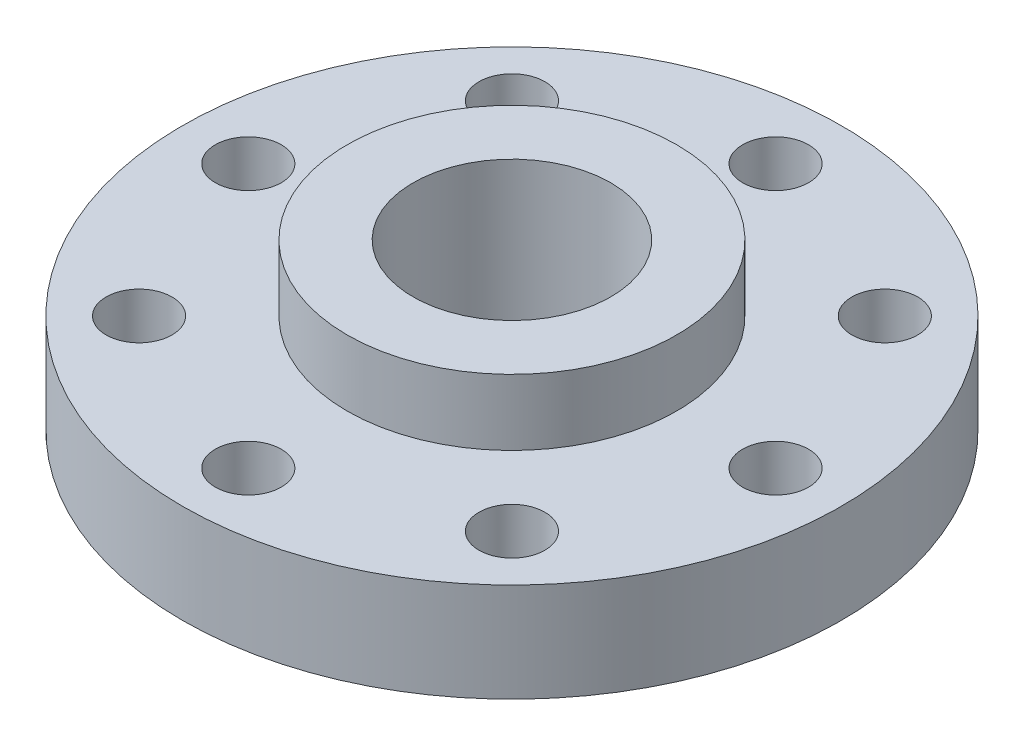
ISO-10303-21;
HEADER;
FILE_DESCRIPTION(('STEP AP214'),'2;1');
FILE_NAME('part.step','',(''),(''),'','','');
FILE_SCHEMA(('AUTOMOTIVE_DESIGN { 1 0 10303 214 1 1 1 1 }'));
ENDSEC;
DATA;
#1=APPLICATION_CONTEXT('core data for automotive mechanical design processes');
#2=APPLICATION_PROTOCOL_DEFINITION('international standard','automotive_design',2000,#1);
#3=PRODUCT_CONTEXT('',#1,'mechanical');
#4=PRODUCT('Part','Part','',(#3));
#5=PRODUCT_RELATED_PRODUCT_CATEGORY('part','',(#4));
#6=PRODUCT_DEFINITION_FORMATION('','',#4);
#7=PRODUCT_DEFINITION_CONTEXT('part definition',#1,'design');
#8=PRODUCT_DEFINITION('design','',#6,#7);
#9=PRODUCT_DEFINITION_SHAPE('','',#8);
#10=(LENGTH_UNIT() NAMED_UNIT(*) SI_UNIT(.MILLI.,.METRE.));
#11=(NAMED_UNIT(*) PLANE_ANGLE_UNIT() SI_UNIT($,.RADIAN.));
#12=(NAMED_UNIT(*) SI_UNIT($,.STERADIAN.) SOLID_ANGLE_UNIT());
#13=UNCERTAINTY_MEASURE_WITH_UNIT(LENGTH_MEASURE(1.E-05),#10,'distance_accuracy_value','');
#14=(GEOMETRIC_REPRESENTATION_CONTEXT(3) GLOBAL_UNCERTAINTY_ASSIGNED_CONTEXT((#13)) GLOBAL_UNIT_ASSIGNED_CONTEXT((#10,
#11,#12)) REPRESENTATION_CONTEXT('',''));
#15=CARTESIAN_POINT('',(0.,0.,0.));
#16=DIRECTION('',(0.,0.,1.));
#17=DIRECTION('',(1.,0.,0.));
#18=AXIS2_PLACEMENT_3D('',#15,#16,#17);
#19=CARTESIAN_POINT('',(0.,3.,0.));
#20=DIRECTION('',(0.,-1.,0.));
#21=DIRECTION('',(0.,0.,-1.));
#22=AXIS2_PLACEMENT_3D('',#19,#20,#21);
#23=CYLINDRICAL_SURFACE('',#22,10.);
#24=CARTESIAN_POINT('',(0.,3.,0.));
#25=DIRECTION('',(0.,1.,0.));
#26=DIRECTION('',(0.,0.,1.));
#27=AXIS2_PLACEMENT_3D('',#24,#25,#26);
#28=CIRCLE('',#27,10.);
#29=CARTESIAN_POINT('',(0.,3.,10.));
#30=VERTEX_POINT('',#29);
#31=EDGE_CURVE('E45',#30,#30,#28,.T.);
#32=ORIENTED_EDGE('',*,*,#31,.F.);
#33=EDGE_LOOP('',(#32));
#34=FACE_BOUND('',#33,.T.);
#35=CARTESIAN_POINT('',(0.,0.,0.));
#36=DIRECTION('',(0.,1.,0.));
#37=DIRECTION('',(0.,0.,1.));
#38=AXIS2_PLACEMENT_3D('',#35,#36,#37);
#39=CIRCLE('',#38,10.);
#40=CARTESIAN_POINT('',(0.,0.,10.));
#41=VERTEX_POINT('',#40);
#42=EDGE_CURVE('E40',#41,#41,#39,.T.);
#43=ORIENTED_EDGE('',*,*,#42,.T.);
#44=EDGE_LOOP('',(#43));
#45=FACE_BOUND('',#44,.T.);
#46=ADVANCED_FACE('F37',(#34,#45),#23,.T.);
#47=CARTESIAN_POINT('',(0.,3.,0.));
#48=DIRECTION('',(0.,1.,0.));
#49=DIRECTION('',(0.,0.,1.));
#50=AXIS2_PLACEMENT_3D('',#47,#48,#49);
#51=PLANE('',#50);
#52=CARTESIAN_POINT('',(0.,3.,8.));
#53=DIRECTION('',(0.,1.,0.));
#54=DIRECTION('',(0.,0.,1.));
#55=AXIS2_PLACEMENT_3D('',#52,#53,#54);
#56=CIRCLE('',#55,1.);
#57=CARTESIAN_POINT('',(0.,3.,9.));
#58=VERTEX_POINT('',#57);
#59=EDGE_CURVE('E56',#58,#58,#56,.T.);
#60=ORIENTED_EDGE('',*,*,#59,.F.);
#61=EDGE_LOOP('',(#60));
#62=FACE_BOUND('',#61,.T.);
#63=CARTESIAN_POINT('',(5.65685424949245,3.,5.65685424949262));
#64=DIRECTION('',(0.,1.,0.));
#65=DIRECTION('',(0.,0.,1.));
#66=AXIS2_PLACEMENT_3D('',#63,#64,#65);
#67=CIRCLE('',#66,1.);
#68=CARTESIAN_POINT('',(5.65685424949245,3.,6.65685424949262));
#69=VERTEX_POINT('',#68);
#70=EDGE_CURVE('E60',#69,#69,#67,.T.);
#71=ORIENTED_EDGE('',*,*,#70,.F.);
#72=EDGE_LOOP('',(#71));
#73=FACE_BOUND('',#72,.T.);
#74=CARTESIAN_POINT('',(8.00000000000031,3.,3.3963373171828E-13));
#75=DIRECTION('',(0.,1.,0.));
#76=DIRECTION('',(0.,0.,1.));
#77=AXIS2_PLACEMENT_3D('',#74,#75,#76);
#78=CIRCLE('',#77,1.);
#79=CARTESIAN_POINT('',(8.00000000000031,3.,1.00000000000034));
#80=VERTEX_POINT('',#79);
#81=EDGE_CURVE('E64',#80,#80,#78,.T.);
#82=ORIENTED_EDGE('',*,*,#81,.F.);
#83=EDGE_LOOP('',(#82));
#84=FACE_BOUND('',#83,.T.);
#85=CARTESIAN_POINT('',(5.65685424949293,3.,-5.65685424949214));
#86=DIRECTION('',(0.,1.,0.));
#87=DIRECTION('',(0.,0.,1.));
#88=AXIS2_PLACEMENT_3D('',#85,#86,#87);
#89=CIRCLE('',#88,1.);
#90=CARTESIAN_POINT('',(5.65685424949293,3.,-4.65685424949214));
#91=VERTEX_POINT('',#90);
#92=EDGE_CURVE('E68',#91,#91,#89,.T.);
#93=ORIENTED_EDGE('',*,*,#92,.F.);
#94=EDGE_LOOP('',(#93));
#95=FACE_BOUND('',#94,.T.);
#96=CARTESIAN_POINT('',(6.49541144935068E-13,3.,-8.));
#97=DIRECTION('',(0.,1.,0.));
#98=DIRECTION('',(0.,0.,1.));
#99=AXIS2_PLACEMENT_3D('',#96,#97,#98);
#100=CIRCLE('',#99,1.);
#101=CARTESIAN_POINT('',(6.49541144935068E-13,3.,-7.));
#102=VERTEX_POINT('',#101);
#103=EDGE_CURVE('E72',#102,#102,#100,.T.);
#104=ORIENTED_EDGE('',*,*,#103,.F.);
#105=EDGE_LOOP('',(#104));
#106=FACE_BOUND('',#105,.T.);
#107=CARTESIAN_POINT('',(-5.65685424949183,3.,-5.65685424949262));
#108=DIRECTION('',(0.,1.,0.));
#109=DIRECTION('',(0.,0.,1.));
#110=AXIS2_PLACEMENT_3D('',#107,#108,#109);
#111=CIRCLE('',#110,1.);
#112=CARTESIAN_POINT('',(-5.65685424949183,3.,-4.65685424949262));
#113=VERTEX_POINT('',#112);
#114=EDGE_CURVE('E76',#113,#113,#111,.T.);
#115=ORIENTED_EDGE('',*,*,#114,.F.);
#116=EDGE_LOOP('',(#115));
#117=FACE_BOUND('',#116,.T.);
#118=CARTESIAN_POINT('',(-7.99999999999969,3.,-3.40527859732781E-13));
#119=DIRECTION('',(0.,1.,0.));
#120=DIRECTION('',(0.,0.,1.));
#121=AXIS2_PLACEMENT_3D('',#118,#119,#120);
#122=CIRCLE('',#121,1.);
#123=CARTESIAN_POINT('',(-7.99999999999969,3.,0.999999999999659));
#124=VERTEX_POINT('',#123);
#125=EDGE_CURVE('E80',#124,#124,#122,.T.);
#126=ORIENTED_EDGE('',*,*,#125,.F.);
#127=EDGE_LOOP('',(#126));
#128=FACE_BOUND('',#127,.T.);
#129=CARTESIAN_POINT('',(-5.65685424949231,3.,5.65685424949214));
#130=DIRECTION('',(0.,1.,0.));
#131=DIRECTION('',(0.,0.,1.));
#132=AXIS2_PLACEMENT_3D('',#129,#130,#131);
#133=CIRCLE('',#132,0.999999999999999);
#134=CARTESIAN_POINT('',(-5.65685424949231,3.,6.65685424949214));
#135=VERTEX_POINT('',#134);
#136=EDGE_CURVE('E84',#135,#135,#133,.T.);
#137=ORIENTED_EDGE('',*,*,#136,.F.);
#138=EDGE_LOOP('',(#137));
#139=FACE_BOUND('',#138,.T.);
#140=CARTESIAN_POINT('',(0.,3.,0.));
#141=DIRECTION('',(0.,1.,0.));
#142=DIRECTION('',(0.,0.,1.));
#143=AXIS2_PLACEMENT_3D('',#140,#141,#142);
#144=CIRCLE('',#143,5.);
#145=CARTESIAN_POINT('',(0.,3.,5.));
#146=VERTEX_POINT('',#145);
#147=EDGE_CURVE('E10',#146,#146,#144,.T.);
#148=ORIENTED_EDGE('',*,*,#147,.F.);
#149=EDGE_LOOP('',(#148));
#150=FACE_BOUND('',#149,.T.);
#151=ORIENTED_EDGE('',*,*,#31,.T.);
#152=EDGE_LOOP('',(#151));
#153=FACE_BOUND('',#152,.T.);
#154=ADVANCED_FACE('F135',(#62,#73,#84,#95,#106,#117,#128,#139,#150,#153),#51,.T.);
#155=CARTESIAN_POINT('',(0.,0.,0.));
#156=DIRECTION('',(0.,1.,0.));
#157=DIRECTION('',(0.,0.,1.));
#158=AXIS2_PLACEMENT_3D('',#155,#156,#157);
#159=PLANE('',#158);
#160=CARTESIAN_POINT('',(0.,0.,8.));
#161=DIRECTION('',(0.,-1.,0.));
#162=DIRECTION('',(0.,0.,-1.));
#163=AXIS2_PLACEMENT_3D('',#160,#161,#162);
#164=CIRCLE('',#163,1.);
#165=CARTESIAN_POINT('',(0.,0.,7.));
#166=VERTEX_POINT('',#165);
#167=EDGE_CURVE('E93',#166,#166,#164,.T.);
#168=ORIENTED_EDGE('',*,*,#167,.F.);
#169=EDGE_LOOP('',(#168));
#170=FACE_BOUND('',#169,.T.);
#171=CARTESIAN_POINT('',(5.65685424949245,0.,5.65685424949262));
#172=DIRECTION('',(0.,-1.,0.));
#173=DIRECTION('',(0.,0.,-1.));
#174=AXIS2_PLACEMENT_3D('',#171,#172,#173);
#175=CIRCLE('',#174,1.);
#176=CARTESIAN_POINT('',(5.65685424949245,0.,4.65685424949262));
#177=VERTEX_POINT('',#176);
#178=EDGE_CURVE('E106',#177,#177,#175,.T.);
#179=ORIENTED_EDGE('',*,*,#178,.F.);
#180=EDGE_LOOP('',(#179));
#181=FACE_BOUND('',#180,.T.);
#182=CARTESIAN_POINT('',(8.00000000000031,0.,3.3963373171828E-13));
#183=DIRECTION('',(0.,-1.,0.));
#184=DIRECTION('',(0.,0.,-1.));
#185=AXIS2_PLACEMENT_3D('',#182,#183,#184);
#186=CIRCLE('',#185,1.);
#187=CARTESIAN_POINT('',(8.00000000000031,0.,-0.999999999999662));
#188=VERTEX_POINT('',#187);
#189=EDGE_CURVE('E101',#188,#188,#186,.T.);
#190=ORIENTED_EDGE('',*,*,#189,.F.);
#191=EDGE_LOOP('',(#190));
#192=FACE_BOUND('',#191,.T.);
#193=CARTESIAN_POINT('',(5.65685424949293,0.,-5.65685424949214));
#194=DIRECTION('',(0.,-1.,0.));
#195=DIRECTION('',(0.,0.,-1.));
#196=AXIS2_PLACEMENT_3D('',#193,#194,#195);
#197=CIRCLE('',#196,1.);
#198=CARTESIAN_POINT('',(5.65685424949293,0.,-6.65685424949214));
#199=VERTEX_POINT('',#198);
#200=EDGE_CURVE('E97',#199,#199,#197,.T.);
#201=ORIENTED_EDGE('',*,*,#200,.F.);
#202=EDGE_LOOP('',(#201));
#203=FACE_BOUND('',#202,.T.);
#204=CARTESIAN_POINT('',(6.49541144935068E-13,0.,-8.));
#205=DIRECTION('',(0.,-1.,0.));
#206=DIRECTION('',(0.,0.,-1.));
#207=AXIS2_PLACEMENT_3D('',#204,#205,#206);
#208=CIRCLE('',#207,1.);
#209=CARTESIAN_POINT('',(6.49541144935068E-13,0.,-9.));
#210=VERTEX_POINT('',#209);
#211=EDGE_CURVE('E102',#210,#210,#208,.T.);
#212=ORIENTED_EDGE('',*,*,#211,.F.);
#213=EDGE_LOOP('',(#212));
#214=FACE_BOUND('',#213,.T.);
#215=CARTESIAN_POINT('',(-5.65685424949183,0.,-5.65685424949262));
#216=DIRECTION('',(0.,-1.,0.));
#217=DIRECTION('',(0.,0.,-1.));
#218=AXIS2_PLACEMENT_3D('',#215,#216,#217);
#219=CIRCLE('',#218,1.);
#220=CARTESIAN_POINT('',(-5.65685424949183,0.,-6.65685424949262));
#221=VERTEX_POINT('',#220);
#222=EDGE_CURVE('E121',#221,#221,#219,.T.);
#223=ORIENTED_EDGE('',*,*,#222,.F.);
#224=EDGE_LOOP('',(#223));
#225=FACE_BOUND('',#224,.T.);
#226=CARTESIAN_POINT('',(-7.99999999999969,0.,-3.40527859732781E-13));
#227=DIRECTION('',(0.,-1.,0.));
#228=DIRECTION('',(0.,0.,-1.));
#229=AXIS2_PLACEMENT_3D('',#226,#227,#228);
#230=CIRCLE('',#229,1.);
#231=CARTESIAN_POINT('',(-7.99999999999969,0.,-1.00000000000034));
#232=VERTEX_POINT('',#231);
#233=EDGE_CURVE('E117',#232,#232,#230,.T.);
#234=ORIENTED_EDGE('',*,*,#233,.F.);
#235=EDGE_LOOP('',(#234));
#236=FACE_BOUND('',#235,.T.);
#237=CARTESIAN_POINT('',(-5.65685424949231,0.,5.65685424949214));
#238=DIRECTION('',(0.,-1.,0.));
#239=DIRECTION('',(0.,0.,-1.));
#240=AXIS2_PLACEMENT_3D('',#237,#238,#239);
#241=CIRCLE('',#240,0.999999999999999);
#242=CARTESIAN_POINT('',(-5.65685424949231,0.,4.65685424949214));
#243=VERTEX_POINT('',#242);
#244=EDGE_CURVE('E113',#243,#243,#241,.T.);
#245=ORIENTED_EDGE('',*,*,#244,.F.);
#246=EDGE_LOOP('',(#245));
#247=FACE_BOUND('',#246,.T.);
#248=CARTESIAN_POINT('',(0.,0.,0.));
#249=DIRECTION('',(0.,-1.,0.));
#250=DIRECTION('',(0.,0.,-1.));
#251=AXIS2_PLACEMENT_3D('',#248,#249,#250);
#252=CIRCLE('',#251,3.);
#253=CARTESIAN_POINT('',(0.,0.,-3.));
#254=VERTEX_POINT('',#253);
#255=EDGE_CURVE('E89',#254,#254,#252,.T.);
#256=ORIENTED_EDGE('',*,*,#255,.F.);
#257=EDGE_LOOP('',(#256));
#258=FACE_BOUND('',#257,.T.);
#259=ORIENTED_EDGE('',*,*,#42,.F.);
#260=EDGE_LOOP('',(#259));
#261=FACE_BOUND('',#260,.T.);
#262=ADVANCED_FACE('F131',(#170,#181,#192,#203,#214,#225,#236,#247,#258,#261),#159,.F.);
#263=CARTESIAN_POINT('',(0.,5.,0.));
#264=DIRECTION('',(0.,-1.,0.));
#265=DIRECTION('',(0.,0.,-1.));
#266=AXIS2_PLACEMENT_3D('',#263,#264,#265);
#267=CYLINDRICAL_SURFACE('',#266,5.);
#268=CARTESIAN_POINT('',(0.,5.,0.));
#269=DIRECTION('',(0.,1.,0.));
#270=DIRECTION('',(0.,0.,1.));
#271=AXIS2_PLACEMENT_3D('',#268,#269,#270);
#272=CIRCLE('',#271,5.);
#273=CARTESIAN_POINT('',(0.,5.,5.));
#274=VERTEX_POINT('',#273);
#275=EDGE_CURVE('E52',#274,#274,#272,.T.);
#276=ORIENTED_EDGE('',*,*,#275,.F.);
#277=EDGE_LOOP('',(#276));
#278=FACE_BOUND('',#277,.T.);
#279=ORIENTED_EDGE('',*,*,#147,.T.);
#280=EDGE_LOOP('',(#279));
#281=FACE_BOUND('',#280,.T.);
#282=ADVANCED_FACE('F134',(#278,#281),#267,.T.);
#283=CARTESIAN_POINT('',(0.,5.,0.));
#284=DIRECTION('',(0.,1.,0.));
#285=DIRECTION('',(0.,0.,1.));
#286=AXIS2_PLACEMENT_3D('',#283,#284,#285);
#287=PLANE('',#286);
#288=CARTESIAN_POINT('',(0.,5.,0.));
#289=DIRECTION('',(0.,-1.,0.));
#290=DIRECTION('',(0.,0.,-1.));
#291=AXIS2_PLACEMENT_3D('',#288,#289,#290);
#292=CIRCLE('',#291,3.);
#293=CARTESIAN_POINT('',(0.,5.,-3.));
#294=VERTEX_POINT('',#293);
#295=EDGE_CURVE('E88',#294,#294,#292,.T.);
#296=ORIENTED_EDGE('',*,*,#295,.T.);
#297=EDGE_LOOP('',(#296));
#298=FACE_BOUND('',#297,.T.);
#299=ORIENTED_EDGE('',*,*,#275,.T.);
#300=EDGE_LOOP('',(#299));
#301=FACE_BOUND('',#300,.T.);
#302=ADVANCED_FACE('F165',(#298,#301),#287,.T.);
#303=CARTESIAN_POINT('',(0.,5.,0.));
#304=DIRECTION('',(0.,-1.,0.));
#305=DIRECTION('',(0.,0.,-1.));
#306=AXIS2_PLACEMENT_3D('',#303,#304,#305);
#307=CYLINDRICAL_SURFACE('',#306,3.);
#308=ORIENTED_EDGE('',*,*,#295,.F.);
#309=EDGE_LOOP('',(#308));
#310=FACE_BOUND('',#309,.T.);
#311=ORIENTED_EDGE('',*,*,#255,.T.);
#312=EDGE_LOOP('',(#311));
#313=FACE_BOUND('',#312,.T.);
#314=ADVANCED_FACE('F169',(#310,#313),#307,.F.);
#315=CARTESIAN_POINT('',(-5.65685424949231,5.,5.65685424949214));
#316=DIRECTION('',(0.,-1.,0.));
#317=DIRECTION('',(0.,0.,-1.));
#318=AXIS2_PLACEMENT_3D('',#315,#316,#317);
#319=CYLINDRICAL_SURFACE('',#318,0.999999999999999);
#320=ORIENTED_EDGE('',*,*,#136,.T.);
#321=EDGE_LOOP('',(#320));
#322=FACE_BOUND('',#321,.T.);
#323=ORIENTED_EDGE('',*,*,#244,.T.);
#324=EDGE_LOOP('',(#323));
#325=FACE_BOUND('',#324,.T.);
#326=ADVANCED_FACE('F173',(#322,#325),#319,.F.);
#327=CARTESIAN_POINT('',(-7.99999999999969,5.,-3.40527859732781E-13));
#328=DIRECTION('',(0.,-1.,0.));
#329=DIRECTION('',(0.,0.,-1.));
#330=AXIS2_PLACEMENT_3D('',#327,#328,#329);
#331=CYLINDRICAL_SURFACE('',#330,1.);
#332=ORIENTED_EDGE('',*,*,#125,.T.);
#333=EDGE_LOOP('',(#332));
#334=FACE_BOUND('',#333,.T.);
#335=ORIENTED_EDGE('',*,*,#233,.T.);
#336=EDGE_LOOP('',(#335));
#337=FACE_BOUND('',#336,.T.);
#338=ADVANCED_FACE('F193',(#334,#337),#331,.F.);
#339=CARTESIAN_POINT('',(-5.65685424949183,5.,-5.65685424949262));
#340=DIRECTION('',(0.,-1.,0.));
#341=DIRECTION('',(0.,0.,-1.));
#342=AXIS2_PLACEMENT_3D('',#339,#340,#341);
#343=CYLINDRICAL_SURFACE('',#342,1.);
#344=ORIENTED_EDGE('',*,*,#114,.T.);
#345=EDGE_LOOP('',(#344));
#346=FACE_BOUND('',#345,.T.);
#347=ORIENTED_EDGE('',*,*,#222,.T.);
#348=EDGE_LOOP('',(#347));
#349=FACE_BOUND('',#348,.T.);
#350=ADVANCED_FACE('F197',(#346,#349),#343,.F.);
#351=CARTESIAN_POINT('',(6.49541144935068E-13,5.,-8.));
#352=DIRECTION('',(0.,-1.,0.));
#353=DIRECTION('',(0.,0.,-1.));
#354=AXIS2_PLACEMENT_3D('',#351,#352,#353);
#355=CYLINDRICAL_SURFACE('',#354,1.);
#356=ORIENTED_EDGE('',*,*,#103,.T.);
#357=EDGE_LOOP('',(#356));
#358=FACE_BOUND('',#357,.T.);
#359=ORIENTED_EDGE('',*,*,#211,.T.);
#360=EDGE_LOOP('',(#359));
#361=FACE_BOUND('',#360,.T.);
#362=ADVANCED_FACE('F129',(#358,#361),#355,.F.);
#363=CARTESIAN_POINT('',(5.65685424949293,5.,-5.65685424949214));
#364=DIRECTION('',(0.,-1.,0.));
#365=DIRECTION('',(0.,0.,-1.));
#366=AXIS2_PLACEMENT_3D('',#363,#364,#365);
#367=CYLINDRICAL_SURFACE('',#366,1.);
#368=ORIENTED_EDGE('',*,*,#92,.T.);
#369=EDGE_LOOP('',(#368));
#370=FACE_BOUND('',#369,.T.);
#371=ORIENTED_EDGE('',*,*,#200,.T.);
#372=EDGE_LOOP('',(#371));
#373=FACE_BOUND('',#372,.T.);
#374=ADVANCED_FACE('F175',(#370,#373),#367,.F.);
#375=CARTESIAN_POINT('',(8.00000000000031,5.,3.3963373171828E-13));
#376=DIRECTION('',(0.,-1.,0.));
#377=DIRECTION('',(0.,0.,-1.));
#378=AXIS2_PLACEMENT_3D('',#375,#376,#377);
#379=CYLINDRICAL_SURFACE('',#378,1.);
#380=ORIENTED_EDGE('',*,*,#81,.T.);
#381=EDGE_LOOP('',(#380));
#382=FACE_BOUND('',#381,.T.);
#383=ORIENTED_EDGE('',*,*,#189,.T.);
#384=EDGE_LOOP('',(#383));
#385=FACE_BOUND('',#384,.T.);
#386=ADVANCED_FACE('F178',(#382,#385),#379,.F.);
#387=CARTESIAN_POINT('',(5.65685424949245,5.,5.65685424949262));
#388=DIRECTION('',(0.,-1.,0.));
#389=DIRECTION('',(0.,0.,-1.));
#390=AXIS2_PLACEMENT_3D('',#387,#388,#389);
#391=CYLINDRICAL_SURFACE('',#390,1.);
#392=ORIENTED_EDGE('',*,*,#70,.T.);
#393=EDGE_LOOP('',(#392));
#394=FACE_BOUND('',#393,.T.);
#395=ORIENTED_EDGE('',*,*,#178,.T.);
#396=EDGE_LOOP('',(#395));
#397=FACE_BOUND('',#396,.T.);
#398=ADVANCED_FACE('F182',(#394,#397),#391,.F.);
#399=CARTESIAN_POINT('',(0.,5.,8.));
#400=DIRECTION('',(0.,-1.,0.));
#401=DIRECTION('',(0.,0.,-1.));
#402=AXIS2_PLACEMENT_3D('',#399,#400,#401);
#403=CYLINDRICAL_SURFACE('',#402,1.);
#404=ORIENTED_EDGE('',*,*,#59,.T.);
#405=EDGE_LOOP('',(#404));
#406=FACE_BOUND('',#405,.T.);
#407=ORIENTED_EDGE('',*,*,#167,.T.);
#408=EDGE_LOOP('',(#407));
#409=FACE_BOUND('',#408,.T.);
#410=ADVANCED_FACE('F186',(#406,#409),#403,.F.);
#411=CLOSED_SHELL('',(#46,#154,#262,#282,#302,#314,#326,#338,#350,#362,#374,#386,#398,#410));
#412=MANIFOLD_SOLID_BREP('B2',#411);
#413=ADVANCED_BREP_SHAPE_REPRESENTATION('',(#18,#412),#14);
#414=SHAPE_DEFINITION_REPRESENTATION(#9,#413);
ENDSEC;
END-ISO-10303-21;
